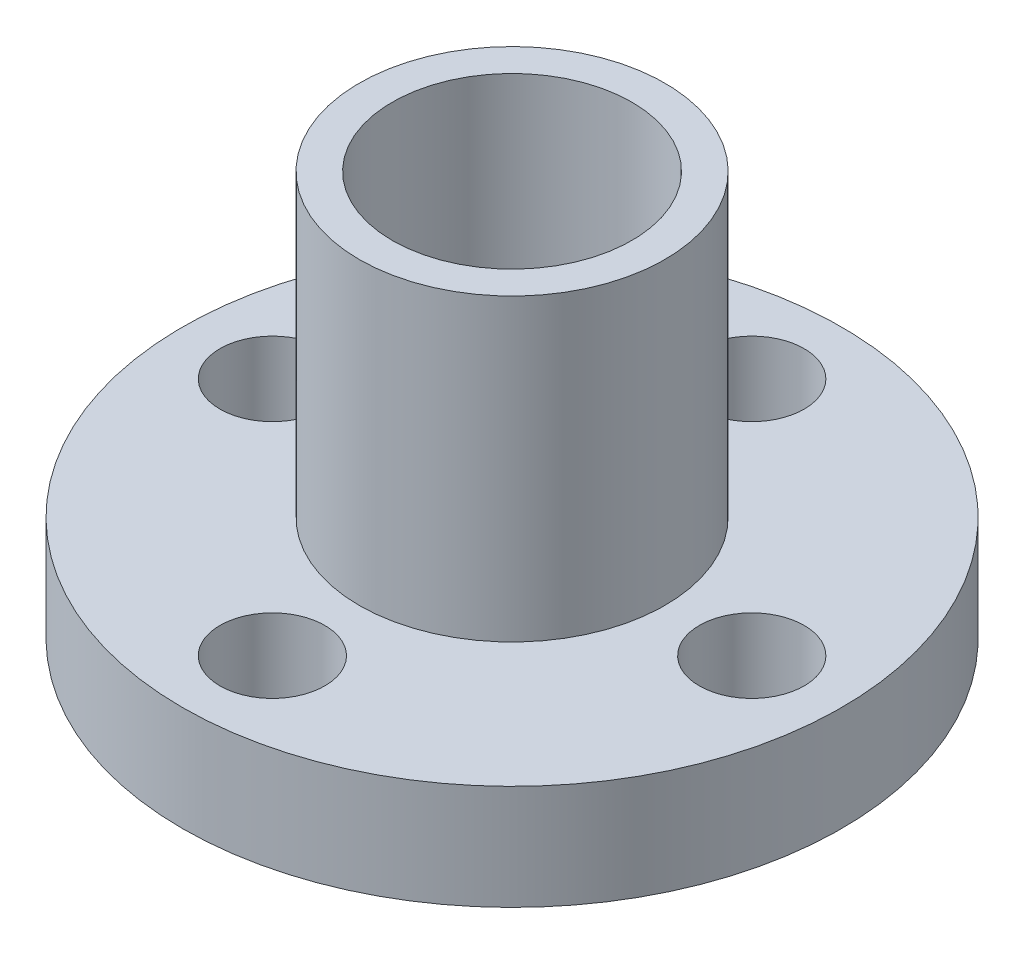
ISO-10303-21;
HEADER;
FILE_DESCRIPTION(('STEP AP214'),'2;1');
FILE_NAME('part.step','',(''),(''),'','','');
FILE_SCHEMA(('AUTOMOTIVE_DESIGN { 1 0 10303 214 1 1 1 1 }'));
ENDSEC;
DATA;
#1=APPLICATION_CONTEXT('core data for automotive mechanical design processes');
#2=APPLICATION_PROTOCOL_DEFINITION('international standard','automotive_design',2000,#1);
#3=PRODUCT_CONTEXT('',#1,'mechanical');
#4=PRODUCT('Part','Part','',(#3));
#5=PRODUCT_RELATED_PRODUCT_CATEGORY('part','',(#4));
#6=PRODUCT_DEFINITION_FORMATION('','',#4);
#7=PRODUCT_DEFINITION_CONTEXT('part definition',#1,'design');
#8=PRODUCT_DEFINITION('design','',#6,#7);
#9=PRODUCT_DEFINITION_SHAPE('','',#8);
#10=(LENGTH_UNIT() NAMED_UNIT(*) SI_UNIT(.MILLI.,.METRE.));
#11=(NAMED_UNIT(*) PLANE_ANGLE_UNIT() SI_UNIT($,.RADIAN.));
#12=(NAMED_UNIT(*) SI_UNIT($,.STERADIAN.) SOLID_ANGLE_UNIT());
#13=UNCERTAINTY_MEASURE_WITH_UNIT(LENGTH_MEASURE(1.E-05),#10,'distance_accuracy_value','');
#14=(GEOMETRIC_REPRESENTATION_CONTEXT(3) GLOBAL_UNCERTAINTY_ASSIGNED_CONTEXT((#13)) GLOBAL_UNIT_ASSIGNED_CONTEXT((#10,
#11,#12)) REPRESENTATION_CONTEXT('',''));
#15=CARTESIAN_POINT('',(0.,0.,0.));
#16=DIRECTION('',(0.,0.,1.));
#17=DIRECTION('',(1.,0.,0.));
#18=AXIS2_PLACEMENT_3D('',#15,#16,#17);
#19=CARTESIAN_POINT('',(0.,1.5,0.));
#20=DIRECTION('',(0.,-1.,0.));
#21=DIRECTION('',(0.,0.,-1.));
#22=AXIS2_PLACEMENT_3D('',#19,#20,#21);
#23=CYLINDRICAL_SURFACE('',#22,5.1);
#24=CARTESIAN_POINT('',(0.,1.5,0.));
#25=DIRECTION('',(0.,1.,0.));
#26=DIRECTION('',(0.,0.,1.));
#27=AXIS2_PLACEMENT_3D('',#24,#25,#26);
#28=CIRCLE('',#27,5.1);
#29=CARTESIAN_POINT('',(0.,1.5,5.1));
#30=VERTEX_POINT('',#29);
#31=EDGE_CURVE('E46',#30,#30,#28,.T.);
#32=ORIENTED_EDGE('',*,*,#31,.F.);
#33=EDGE_LOOP('',(#32));
#34=FACE_BOUND('',#33,.T.);
#35=CARTESIAN_POINT('',(0.,0.,0.));
#36=DIRECTION('',(0.,1.,0.));
#37=DIRECTION('',(0.,0.,1.));
#38=AXIS2_PLACEMENT_3D('',#35,#36,#37);
#39=CIRCLE('',#38,5.1);
#40=CARTESIAN_POINT('',(0.,0.,5.1));
#41=VERTEX_POINT('',#40);
#42=EDGE_CURVE('E54',#41,#41,#39,.T.);
#43=ORIENTED_EDGE('',*,*,#42,.T.);
#44=EDGE_LOOP('',(#43));
#45=FACE_BOUND('',#44,.T.);
#46=ADVANCED_FACE('F38',(#34,#45),#23,.T.);
#47=CARTESIAN_POINT('',(0.,0.,0.));
#48=DIRECTION('',(0.,1.,0.));
#49=DIRECTION('',(0.,0.,1.));
#50=AXIS2_PLACEMENT_3D('',#47,#48,#49);
#51=PLANE('',#50);
#52=CARTESIAN_POINT('',(0.,0.,0.));
#53=DIRECTION('',(0.,1.,0.));
#54=DIRECTION('',(0.,0.,1.));
#55=AXIS2_PLACEMENT_3D('',#52,#53,#54);
#56=CIRCLE('',#55,4.);
#57=CARTESIAN_POINT('',(0.,0.,4.));
#58=VERTEX_POINT('',#57);
#59=EDGE_CURVE('E75',#58,#58,#56,.T.);
#60=ORIENTED_EDGE('',*,*,#59,.T.);
#61=EDGE_LOOP('',(#60));
#62=FACE_BOUND('',#61,.T.);
#63=ORIENTED_EDGE('',*,*,#42,.F.);
#64=EDGE_LOOP('',(#63));
#65=FACE_BOUND('',#64,.T.);
#66=ADVANCED_FACE('F122',(#62,#65),#51,.F.);
#67=CARTESIAN_POINT('',(0.,5.,0.));
#68=DIRECTION('',(0.,-1.,0.));
#69=DIRECTION('',(0.,0.,-1.));
#70=AXIS2_PLACEMENT_3D('',#67,#68,#69);
#71=CYLINDRICAL_SURFACE('',#70,11.);
#72=CARTESIAN_POINT('',(0.,5.,0.));
#73=DIRECTION('',(0.,1.,0.));
#74=DIRECTION('',(0.,0.,1.));
#75=AXIS2_PLACEMENT_3D('',#72,#73,#74);
#76=CIRCLE('',#75,11.);
#77=CARTESIAN_POINT('',(0.,5.,11.));
#78=VERTEX_POINT('',#77);
#79=EDGE_CURVE('E60',#78,#78,#76,.T.);
#80=ORIENTED_EDGE('',*,*,#79,.F.);
#81=EDGE_LOOP('',(#80));
#82=FACE_BOUND('',#81,.T.);
#83=CARTESIAN_POINT('',(0.,1.5,0.));
#84=DIRECTION('',(0.,1.,0.));
#85=DIRECTION('',(0.,0.,1.));
#86=AXIS2_PLACEMENT_3D('',#83,#84,#85);
#87=CIRCLE('',#86,11.);
#88=CARTESIAN_POINT('',(0.,1.5,11.));
#89=VERTEX_POINT('',#88);
#90=EDGE_CURVE('E64',#89,#89,#87,.T.);
#91=ORIENTED_EDGE('',*,*,#90,.T.);
#92=EDGE_LOOP('',(#91));
#93=FACE_BOUND('',#92,.T.);
#94=ADVANCED_FACE('F127',(#82,#93),#71,.T.);
#95=CARTESIAN_POINT('',(0.,5.,0.));
#96=DIRECTION('',(0.,1.,0.));
#97=DIRECTION('',(0.,0.,1.));
#98=AXIS2_PLACEMENT_3D('',#95,#96,#97);
#99=PLANE('',#98);
#100=CARTESIAN_POINT('',(8.,5.,0.));
#101=DIRECTION('',(0.,1.,0.));
#102=DIRECTION('',(0.,0.,1.));
#103=AXIS2_PLACEMENT_3D('',#100,#101,#102);
#104=CIRCLE('',#103,1.75);
#105=CARTESIAN_POINT('',(8.,5.,1.75));
#106=VERTEX_POINT('',#105);
#107=EDGE_CURVE('E95',#106,#106,#104,.T.);
#108=ORIENTED_EDGE('',*,*,#107,.F.);
#109=EDGE_LOOP('',(#108));
#110=FACE_BOUND('',#109,.T.);
#111=CARTESIAN_POINT('',(0.,5.,-8.));
#112=DIRECTION('',(0.,1.,0.));
#113=DIRECTION('',(0.,0.,1.));
#114=AXIS2_PLACEMENT_3D('',#111,#112,#113);
#115=CIRCLE('',#114,1.75);
#116=CARTESIAN_POINT('',(0.,5.,-6.25));
#117=VERTEX_POINT('',#116);
#118=EDGE_CURVE('E82',#117,#117,#115,.T.);
#119=ORIENTED_EDGE('',*,*,#118,.F.);
#120=EDGE_LOOP('',(#119));
#121=FACE_BOUND('',#120,.T.);
#122=CARTESIAN_POINT('',(-8.,5.,0.));
#123=DIRECTION('',(0.,1.,0.));
#124=DIRECTION('',(0.,0.,1.));
#125=AXIS2_PLACEMENT_3D('',#122,#123,#124);
#126=CIRCLE('',#125,1.75);
#127=CARTESIAN_POINT('',(-8.,5.,1.75));
#128=VERTEX_POINT('',#127);
#129=EDGE_CURVE('E79',#128,#128,#126,.T.);
#130=ORIENTED_EDGE('',*,*,#129,.F.);
#131=EDGE_LOOP('',(#130));
#132=FACE_BOUND('',#131,.T.);
#133=CARTESIAN_POINT('',(0.,5.,8.));
#134=DIRECTION('',(0.,1.,0.));
#135=DIRECTION('',(0.,0.,1.));
#136=AXIS2_PLACEMENT_3D('',#133,#134,#135);
#137=CIRCLE('',#136,1.75);
#138=CARTESIAN_POINT('',(0.,5.,9.75));
#139=VERTEX_POINT('',#138);
#140=EDGE_CURVE('E74',#139,#139,#137,.T.);
#141=ORIENTED_EDGE('',*,*,#140,.F.);
#142=EDGE_LOOP('',(#141));
#143=FACE_BOUND('',#142,.T.);
#144=CARTESIAN_POINT('',(0.,5.,0.));
#145=DIRECTION('',(0.,1.,0.));
#146=DIRECTION('',(0.,0.,1.));
#147=AXIS2_PLACEMENT_3D('',#144,#145,#146);
#148=CIRCLE('',#147,5.1);
#149=CARTESIAN_POINT('',(0.,5.,5.1));
#150=VERTEX_POINT('',#149);
#151=EDGE_CURVE('E10',#150,#150,#148,.T.);
#152=ORIENTED_EDGE('',*,*,#151,.F.);
#153=EDGE_LOOP('',(#152));
#154=FACE_BOUND('',#153,.T.);
#155=ORIENTED_EDGE('',*,*,#79,.T.);
#156=EDGE_LOOP('',(#155));
#157=FACE_BOUND('',#156,.T.);
#158=ADVANCED_FACE('F137',(#110,#121,#132,#143,#154,#157),#99,.T.);
#159=CARTESIAN_POINT('',(0.,1.5,0.));
#160=DIRECTION('',(0.,1.,0.));
#161=DIRECTION('',(0.,0.,1.));
#162=AXIS2_PLACEMENT_3D('',#159,#160,#161);
#163=PLANE('',#162);
#164=CARTESIAN_POINT('',(8.,1.5,0.));
#165=DIRECTION('',(0.,1.,0.));
#166=DIRECTION('',(0.,0.,1.));
#167=AXIS2_PLACEMENT_3D('',#164,#165,#166);
#168=CIRCLE('',#167,1.75);
#169=CARTESIAN_POINT('',(8.,1.5,1.75));
#170=VERTEX_POINT('',#169);
#171=EDGE_CURVE('E41',#170,#170,#168,.T.);
#172=ORIENTED_EDGE('',*,*,#171,.T.);
#173=EDGE_LOOP('',(#172));
#174=FACE_BOUND('',#173,.T.);
#175=CARTESIAN_POINT('',(0.,1.5,-8.));
#176=DIRECTION('',(0.,1.,0.));
#177=DIRECTION('',(0.,0.,1.));
#178=AXIS2_PLACEMENT_3D('',#175,#176,#177);
#179=CIRCLE('',#178,1.75);
#180=CARTESIAN_POINT('',(0.,1.5,-6.25));
#181=VERTEX_POINT('',#180);
#182=EDGE_CURVE('E80',#181,#181,#179,.T.);
#183=ORIENTED_EDGE('',*,*,#182,.T.);
#184=EDGE_LOOP('',(#183));
#185=FACE_BOUND('',#184,.T.);
#186=CARTESIAN_POINT('',(-8.,1.5,0.));
#187=DIRECTION('',(0.,1.,0.));
#188=DIRECTION('',(0.,0.,1.));
#189=AXIS2_PLACEMENT_3D('',#186,#187,#188);
#190=CIRCLE('',#189,1.75);
#191=CARTESIAN_POINT('',(-8.,1.5,1.75));
#192=VERTEX_POINT('',#191);
#193=EDGE_CURVE('E76',#192,#192,#190,.T.);
#194=ORIENTED_EDGE('',*,*,#193,.T.);
#195=EDGE_LOOP('',(#194));
#196=FACE_BOUND('',#195,.T.);
#197=CARTESIAN_POINT('',(0.,1.5,8.));
#198=DIRECTION('',(0.,1.,0.));
#199=DIRECTION('',(0.,0.,1.));
#200=AXIS2_PLACEMENT_3D('',#197,#198,#199);
#201=CIRCLE('',#200,1.75);
#202=CARTESIAN_POINT('',(0.,1.5,9.75));
#203=VERTEX_POINT('',#202);
#204=EDGE_CURVE('E70',#203,#203,#201,.T.);
#205=ORIENTED_EDGE('',*,*,#204,.T.);
#206=EDGE_LOOP('',(#205));
#207=FACE_BOUND('',#206,.T.);
#208=ORIENTED_EDGE('',*,*,#31,.T.);
#209=EDGE_LOOP('',(#208));
#210=FACE_BOUND('',#209,.T.);
#211=ORIENTED_EDGE('',*,*,#90,.F.);
#212=EDGE_LOOP('',(#211));
#213=FACE_BOUND('',#212,.T.);
#214=ADVANCED_FACE('F108',(#174,#185,#196,#207,#210,#213),#163,.F.);
#215=CARTESIAN_POINT('',(0.,15.,0.));
#216=DIRECTION('',(0.,-1.,0.));
#217=DIRECTION('',(0.,0.,-1.));
#218=AXIS2_PLACEMENT_3D('',#215,#216,#217);
#219=CYLINDRICAL_SURFACE('',#218,5.1);
#220=CARTESIAN_POINT('',(0.,15.,0.));
#221=DIRECTION('',(0.,1.,0.));
#222=DIRECTION('',(0.,0.,1.));
#223=AXIS2_PLACEMENT_3D('',#220,#221,#222);
#224=CIRCLE('',#223,5.1);
#225=CARTESIAN_POINT('',(0.,15.,5.1));
#226=VERTEX_POINT('',#225);
#227=EDGE_CURVE('E58',#226,#226,#224,.T.);
#228=ORIENTED_EDGE('',*,*,#227,.F.);
#229=EDGE_LOOP('',(#228));
#230=FACE_BOUND('',#229,.T.);
#231=ORIENTED_EDGE('',*,*,#151,.T.);
#232=EDGE_LOOP('',(#231));
#233=FACE_BOUND('',#232,.T.);
#234=ADVANCED_FACE('F136',(#230,#233),#219,.T.);
#235=CARTESIAN_POINT('',(0.,15.,0.));
#236=DIRECTION('',(0.,1.,0.));
#237=DIRECTION('',(0.,0.,1.));
#238=AXIS2_PLACEMENT_3D('',#235,#236,#237);
#239=PLANE('',#238);
#240=CARTESIAN_POINT('',(0.,15.,0.));
#241=DIRECTION('',(0.,1.,0.));
#242=DIRECTION('',(0.,0.,1.));
#243=AXIS2_PLACEMENT_3D('',#240,#241,#242);
#244=CIRCLE('',#243,4.);
#245=CARTESIAN_POINT('',(0.,15.,4.));
#246=VERTEX_POINT('',#245);
#247=EDGE_CURVE('E171',#246,#246,#244,.T.);
#248=ORIENTED_EDGE('',*,*,#247,.F.);
#249=EDGE_LOOP('',(#248));
#250=FACE_BOUND('',#249,.T.);
#251=ORIENTED_EDGE('',*,*,#227,.T.);
#252=EDGE_LOOP('',(#251));
#253=FACE_BOUND('',#252,.T.);
#254=ADVANCED_FACE('F153',(#250,#253),#239,.T.);
#255=CARTESIAN_POINT('',(0.,0.,0.));
#256=DIRECTION('',(0.,1.,0.));
#257=DIRECTION('',(0.,0.,1.));
#258=AXIS2_PLACEMENT_3D('',#255,#256,#257);
#259=CYLINDRICAL_SURFACE('',#258,4.);
#260=ORIENTED_EDGE('',*,*,#59,.F.);
#261=EDGE_LOOP('',(#260));
#262=FACE_BOUND('',#261,.T.);
#263=ORIENTED_EDGE('',*,*,#247,.T.);
#264=EDGE_LOOP('',(#263));
#265=FACE_BOUND('',#264,.T.);
#266=ADVANCED_FACE('F157',(#262,#265),#259,.F.);
#267=CARTESIAN_POINT('',(0.,0.,8.));
#268=DIRECTION('',(0.,1.,0.));
#269=DIRECTION('',(0.,0.,1.));
#270=AXIS2_PLACEMENT_3D('',#267,#268,#269);
#271=CYLINDRICAL_SURFACE('',#270,1.75);
#272=ORIENTED_EDGE('',*,*,#140,.T.);
#273=EDGE_LOOP('',(#272));
#274=FACE_BOUND('',#273,.T.);
#275=ORIENTED_EDGE('',*,*,#204,.F.);
#276=EDGE_LOOP('',(#275));
#277=FACE_BOUND('',#276,.T.);
#278=ADVANCED_FACE('F160',(#274,#277),#271,.F.);
#279=CARTESIAN_POINT('',(-8.,0.,0.));
#280=DIRECTION('',(0.,1.,0.));
#281=DIRECTION('',(0.,0.,1.));
#282=AXIS2_PLACEMENT_3D('',#279,#280,#281);
#283=CYLINDRICAL_SURFACE('',#282,1.75);
#284=ORIENTED_EDGE('',*,*,#129,.T.);
#285=EDGE_LOOP('',(#284));
#286=FACE_BOUND('',#285,.T.);
#287=ORIENTED_EDGE('',*,*,#193,.F.);
#288=EDGE_LOOP('',(#287));
#289=FACE_BOUND('',#288,.T.);
#290=ADVANCED_FACE('F117',(#286,#289),#283,.F.);
#291=CARTESIAN_POINT('',(0.,0.,-8.));
#292=DIRECTION('',(0.,1.,0.));
#293=DIRECTION('',(0.,0.,1.));
#294=AXIS2_PLACEMENT_3D('',#291,#292,#293);
#295=CYLINDRICAL_SURFACE('',#294,1.75);
#296=ORIENTED_EDGE('',*,*,#118,.T.);
#297=EDGE_LOOP('',(#296));
#298=FACE_BOUND('',#297,.T.);
#299=ORIENTED_EDGE('',*,*,#182,.F.);
#300=EDGE_LOOP('',(#299));
#301=FACE_BOUND('',#300,.T.);
#302=ADVANCED_FACE('F112',(#298,#301),#295,.F.);
#303=CARTESIAN_POINT('',(8.,0.,0.));
#304=DIRECTION('',(0.,1.,0.));
#305=DIRECTION('',(0.,0.,1.));
#306=AXIS2_PLACEMENT_3D('',#303,#304,#305);
#307=CYLINDRICAL_SURFACE('',#306,1.75);
#308=ORIENTED_EDGE('',*,*,#107,.T.);
#309=EDGE_LOOP('',(#308));
#310=FACE_BOUND('',#309,.T.);
#311=ORIENTED_EDGE('',*,*,#171,.F.);
#312=EDGE_LOOP('',(#311));
#313=FACE_BOUND('',#312,.T.);
#314=ADVANCED_FACE('F110',(#310,#313),#307,.F.);
#315=CLOSED_SHELL('',(#46,#66,#94,#158,#214,#234,#254,#266,#278,#290,#302,#314));
#316=MANIFOLD_SOLID_BREP('B2',#315);
#317=ADVANCED_BREP_SHAPE_REPRESENTATION('',(#18,#316),#14);
#318=SHAPE_DEFINITION_REPRESENTATION(#9,#317);
ENDSEC;
END-ISO-10303-21;
